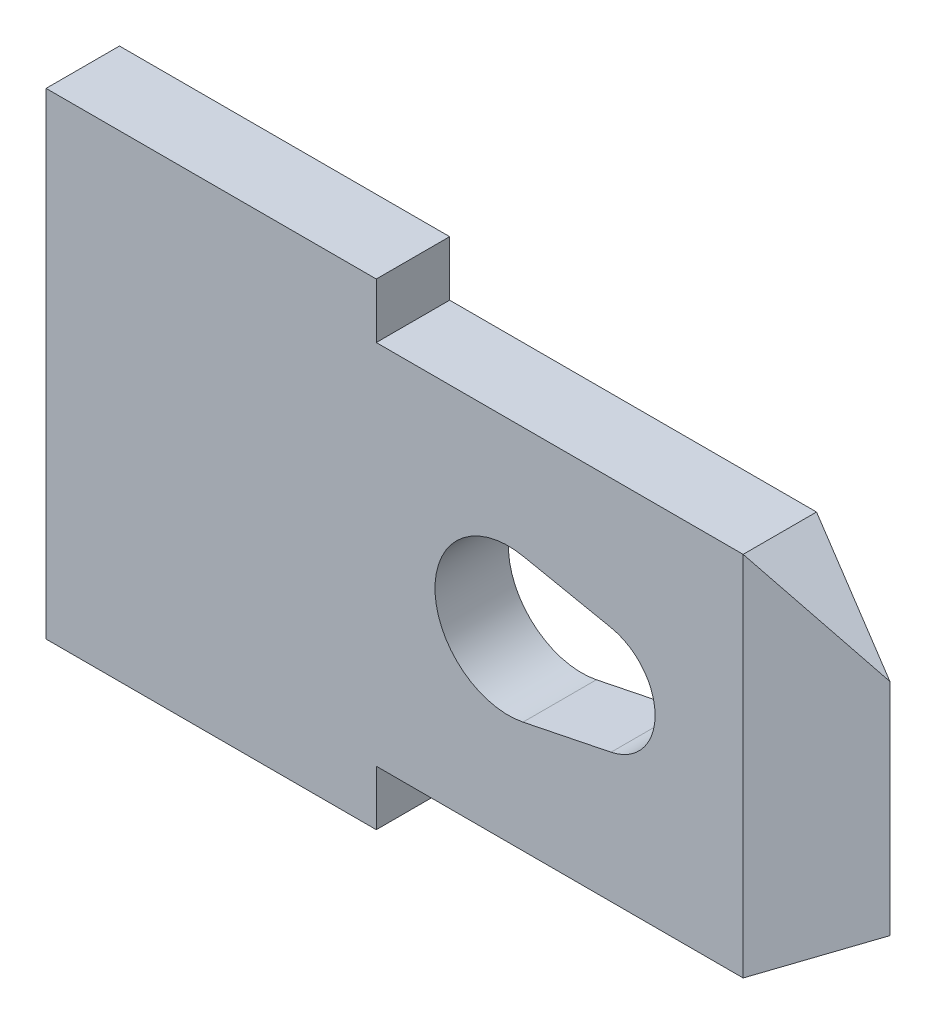
ISO-10303-21;
HEADER;
FILE_DESCRIPTION(('STEP AP214'),'2;1');
FILE_NAME('part.step','',(''),(''),'','','');
FILE_SCHEMA(('AUTOMOTIVE_DESIGN { 1 0 10303 214 1 1 1 1 }'));
ENDSEC;
DATA;
#1=APPLICATION_CONTEXT('core data for automotive mechanical design processes');
#2=APPLICATION_PROTOCOL_DEFINITION('international standard','automotive_design',2000,#1);
#3=PRODUCT_CONTEXT('',#1,'mechanical');
#4=PRODUCT('Part','Part','',(#3));
#5=PRODUCT_RELATED_PRODUCT_CATEGORY('part','',(#4));
#6=PRODUCT_DEFINITION_FORMATION('','',#4);
#7=PRODUCT_DEFINITION_CONTEXT('part definition',#1,'design');
#8=PRODUCT_DEFINITION('design','',#6,#7);
#9=PRODUCT_DEFINITION_SHAPE('','',#8);
#10=(LENGTH_UNIT() NAMED_UNIT(*) SI_UNIT(.MILLI.,.METRE.));
#11=(NAMED_UNIT(*) PLANE_ANGLE_UNIT() SI_UNIT($,.RADIAN.));
#12=(NAMED_UNIT(*) SI_UNIT($,.STERADIAN.) SOLID_ANGLE_UNIT());
#13=UNCERTAINTY_MEASURE_WITH_UNIT(LENGTH_MEASURE(1.E-05),#10,'distance_accuracy_value','');
#14=(GEOMETRIC_REPRESENTATION_CONTEXT(3) GLOBAL_UNCERTAINTY_ASSIGNED_CONTEXT((#13)) GLOBAL_UNIT_ASSIGNED_CONTEXT((#10,
#11,#12)) REPRESENTATION_CONTEXT('',''));
#15=CARTESIAN_POINT('',(0.,0.,0.));
#16=DIRECTION('',(0.,0.,1.));
#17=DIRECTION('',(1.,0.,0.));
#18=AXIS2_PLACEMENT_3D('',#15,#16,#17);
#19=CARTESIAN_POINT('',(9.5,-2.5,1.));
#20=DIRECTION('',(-0.554700196225229,0.832050294337844,0.));
#21=DIRECTION('',(-0.832050294337844,-0.554700196225229,0.));
#22=AXIS2_PLACEMENT_3D('',#19,#20,#21);
#23=PLANE('',#22);
#24=DIRECTION('',(0.801783725737273,0.534522483824849,0.267261241912424));
#25=VECTOR('',#24,1.);
#26=CARTESIAN_POINT('',(3.071,-6.786,-2.143));
#27=LINE('',#26,#25);
#28=CARTESIAN_POINT('',(9.5,-2.5,0.));
#29=VERTEX_POINT('',#28);
#30=CARTESIAN_POINT('',(11.,-1.5,0.499999999999999));
#31=VERTEX_POINT('',#30);
#32=EDGE_CURVE('E140',#29,#31,#27,.T.);
#33=ORIENTED_EDGE('',*,*,#32,.T.);
#34=DIRECTION('',(-0.801783725737273,-0.534522483824849,0.267261241912424));
#35=VECTOR('',#34,1.);
#36=CARTESIAN_POINT('',(3.28528571428572,-6.64314285714286,3.07157142857143));
#37=LINE('',#36,#35);
#38=CARTESIAN_POINT('',(9.5,-2.5,1.));
#39=VERTEX_POINT('',#38);
#40=EDGE_CURVE('E229',#31,#39,#37,.T.);
#41=ORIENTED_EDGE('',*,*,#40,.T.);
#42=DIRECTION('',(0.,0.,-1.));
#43=VECTOR('',#42,1.);
#44=CARTESIAN_POINT('',(9.5,-2.5,1.));
#45=LINE('',#44,#43);
#46=EDGE_CURVE('E183',#39,#29,#45,.T.);
#47=ORIENTED_EDGE('',*,*,#46,.T.);
#48=EDGE_LOOP('',(#33,#41,#47));
#49=FACE_BOUND('',#48,.T.);
#50=ADVANCED_FACE('F40',(#49),#23,.F.);
#51=CARTESIAN_POINT('',(9.5,2.5,1.));
#52=DIRECTION('',(-0.554700196225229,-0.832050294337844,0.));
#53=DIRECTION('',(0.832050294337844,-0.554700196225229,0.));
#54=AXIS2_PLACEMENT_3D('',#51,#52,#53);
#55=PLANE('',#54);
#56=DIRECTION('',(-0.801783725737273,0.534522483824849,-0.267261241912424));
#57=VECTOR('',#56,1.);
#58=CARTESIAN_POINT('',(5.85757142857143,4.92828571428571,-1.21414285714286));
#59=LINE('',#58,#57);
#60=CARTESIAN_POINT('',(11.,1.5,0.5));
#61=VERTEX_POINT('',#60);
#62=CARTESIAN_POINT('',(9.5,2.5,0.));
#63=VERTEX_POINT('',#62);
#64=EDGE_CURVE('E137',#61,#63,#59,.T.);
#65=ORIENTED_EDGE('',*,*,#64,.T.);
#66=DIRECTION('',(0.,0.,-1.));
#67=VECTOR('',#66,1.);
#68=CARTESIAN_POINT('',(9.5,2.5,1.));
#69=LINE('',#68,#67);
#70=CARTESIAN_POINT('',(9.5,2.5,1.));
#71=VERTEX_POINT('',#70);
#72=EDGE_CURVE('E12',#71,#63,#69,.T.);
#73=ORIENTED_EDGE('',*,*,#72,.F.);
#74=DIRECTION('',(0.801783725737273,-0.534522483824849,-0.267261241912424));
#75=VECTOR('',#74,1.);
#76=CARTESIAN_POINT('',(6.07185714285714,4.78542857142857,2.14271428571429));
#77=LINE('',#76,#75);
#78=EDGE_CURVE('E145',#71,#61,#77,.T.);
#79=ORIENTED_EDGE('',*,*,#78,.T.);
#80=EDGE_LOOP('',(#65,#73,#79));
#81=FACE_BOUND('',#80,.T.);
#82=ADVANCED_FACE('F150',(#81),#55,.F.);
#83=CARTESIAN_POINT('',(0.,0.,0.));
#84=DIRECTION('',(0.,0.,-1.));
#85=DIRECTION('',(-1.,0.,0.));
#86=AXIS2_PLACEMENT_3D('',#83,#84,#85);
#87=PLANE('',#86);
#88=CARTESIAN_POINT('',(6.3,0.,0.));
#89=DIRECTION('',(0.,0.,-1.));
#90=DIRECTION('',(-1.,0.,0.));
#91=AXIS2_PLACEMENT_3D('',#88,#89,#90);
#92=CIRCLE('',#91,1.);
#93=CARTESIAN_POINT('',(6.5,0.979795897113271,0.));
#94=VERTEX_POINT('',#93);
#95=CARTESIAN_POINT('',(6.5,-0.979795897113272,0.));
#96=VERTEX_POINT('',#95);
#97=EDGE_CURVE('E243',#94,#96,#92,.F.);
#98=ORIENTED_EDGE('',*,*,#97,.T.);
#99=DIRECTION('',(0.979795897113271,0.2,0.));
#100=VECTOR('',#99,1.);
#101=CARTESIAN_POINT('',(6.5,-0.979795897113272,0.));
#102=LINE('',#101,#100);
#103=CARTESIAN_POINT('',(7.7,-0.734846922834954,0.));
#104=VERTEX_POINT('',#103);
#105=EDGE_CURVE('E163',#96,#104,#102,.T.);
#106=ORIENTED_EDGE('',*,*,#105,.T.);
#107=CARTESIAN_POINT('',(7.55,0.,0.));
#108=DIRECTION('',(0.,0.,-1.));
#109=DIRECTION('',(-1.,0.,0.));
#110=AXIS2_PLACEMENT_3D('',#107,#108,#109);
#111=CIRCLE('',#110,0.75);
#112=CARTESIAN_POINT('',(7.7,0.734846922834953,0.));
#113=VERTEX_POINT('',#112);
#114=EDGE_CURVE('E236',#104,#113,#111,.F.);
#115=ORIENTED_EDGE('',*,*,#114,.T.);
#116=DIRECTION('',(-0.979795897113271,0.2,0.));
#117=VECTOR('',#116,1.);
#118=CARTESIAN_POINT('',(6.5,0.979795897113271,0.));
#119=LINE('',#118,#117);
#120=EDGE_CURVE('E240',#113,#94,#119,.T.);
#121=ORIENTED_EDGE('',*,*,#120,.T.);
#122=EDGE_LOOP('',(#98,#106,#115,#121));
#123=FACE_BOUND('',#122,.T.);
#124=DIRECTION('',(-1.,0.,0.));
#125=VECTOR('',#124,1.);
#126=CARTESIAN_POINT('',(4.5,2.5,0.));
#127=LINE('',#126,#125);
#128=CARTESIAN_POINT('',(4.5,2.5,0.));
#129=VERTEX_POINT('',#128);
#130=EDGE_CURVE('E156',#63,#129,#127,.T.);
#131=ORIENTED_EDGE('',*,*,#130,.F.);
#132=DIRECTION('',(0.,1.,0.));
#133=VECTOR('',#132,1.);
#134=CARTESIAN_POINT('',(9.5,-3.251,0.));
#135=LINE('',#134,#133);
#136=EDGE_CURVE('E134',#29,#63,#135,.T.);
#137=ORIENTED_EDGE('',*,*,#136,.F.);
#138=DIRECTION('',(1.,0.,0.));
#139=VECTOR('',#138,1.);
#140=CARTESIAN_POINT('',(4.5,-2.5,0.));
#141=LINE('',#140,#139);
#142=CARTESIAN_POINT('',(4.5,-2.5,0.));
#143=VERTEX_POINT('',#142);
#144=EDGE_CURVE('E181',#143,#29,#141,.T.);
#145=ORIENTED_EDGE('',*,*,#144,.F.);
#146=DIRECTION('',(0.,1.,0.));
#147=VECTOR('',#146,1.);
#148=CARTESIAN_POINT('',(4.5,-3.25,0.));
#149=LINE('',#148,#147);
#150=CARTESIAN_POINT('',(4.5,-3.25,0.));
#151=VERTEX_POINT('',#150);
#152=EDGE_CURVE('E179',#151,#143,#149,.T.);
#153=ORIENTED_EDGE('',*,*,#152,.F.);
#154=DIRECTION('',(1.,0.,0.));
#155=VECTOR('',#154,1.);
#156=CARTESIAN_POINT('',(0.,-3.25,0.));
#157=LINE('',#156,#155);
#158=CARTESIAN_POINT('',(0.,-3.25,0.));
#159=VERTEX_POINT('',#158);
#160=EDGE_CURVE('E177',#159,#151,#157,.T.);
#161=ORIENTED_EDGE('',*,*,#160,.F.);
#162=DIRECTION('',(0.,-1.,0.));
#163=VECTOR('',#162,1.);
#164=CARTESIAN_POINT('',(0.,-3.25,0.));
#165=LINE('',#164,#163);
#166=CARTESIAN_POINT('',(0.,3.25,0.));
#167=VERTEX_POINT('',#166);
#168=EDGE_CURVE('E175',#167,#159,#165,.T.);
#169=ORIENTED_EDGE('',*,*,#168,.F.);
#170=DIRECTION('',(-1.,0.,0.));
#171=VECTOR('',#170,1.);
#172=CARTESIAN_POINT('',(0.,3.25,0.));
#173=LINE('',#172,#171);
#174=CARTESIAN_POINT('',(4.5,3.25,0.));
#175=VERTEX_POINT('',#174);
#176=EDGE_CURVE('E165',#175,#167,#173,.T.);
#177=ORIENTED_EDGE('',*,*,#176,.F.);
#178=DIRECTION('',(0.,1.,0.));
#179=VECTOR('',#178,1.);
#180=CARTESIAN_POINT('',(4.5,3.25,0.));
#181=LINE('',#180,#179);
#182=EDGE_CURVE('E162',#129,#175,#181,.T.);
#183=ORIENTED_EDGE('',*,*,#182,.F.);
#184=EDGE_LOOP('',(#131,#137,#145,#153,#161,#169,#177,#183));
#185=FACE_BOUND('',#184,.T.);
#186=ADVANCED_FACE('F160',(#123,#185),#87,.T.);
#187=CARTESIAN_POINT('',(0.,0.,1.));
#188=DIRECTION('',(0.,0.,-1.));
#189=DIRECTION('',(-1.,0.,0.));
#190=AXIS2_PLACEMENT_3D('',#187,#188,#189);
#191=PLANE('',#190);
#192=DIRECTION('',(0.979795897113271,0.2,0.));
#193=VECTOR('',#192,1.);
#194=CARTESIAN_POINT('',(6.5,-0.979795897113272,1.));
#195=LINE('',#194,#193);
#196=CARTESIAN_POINT('',(6.5,-0.979795897113271,1.));
#197=VERTEX_POINT('',#196);
#198=CARTESIAN_POINT('',(7.7,-0.734846922834954,1.));
#199=VERTEX_POINT('',#198);
#200=EDGE_CURVE('E247',#197,#199,#195,.T.);
#201=ORIENTED_EDGE('',*,*,#200,.F.);
#202=CARTESIAN_POINT('',(6.3,0.,1.));
#203=DIRECTION('',(0.,0.,1.));
#204=DIRECTION('',(1.,0.,0.));
#205=AXIS2_PLACEMENT_3D('',#202,#203,#204);
#206=CIRCLE('',#205,1.);
#207=CARTESIAN_POINT('',(6.5,0.979795897113271,1.));
#208=VERTEX_POINT('',#207);
#209=EDGE_CURVE('E54',#208,#197,#206,.T.);
#210=ORIENTED_EDGE('',*,*,#209,.F.);
#211=DIRECTION('',(-0.979795897113271,0.2,0.));
#212=VECTOR('',#211,1.);
#213=CARTESIAN_POINT('',(6.5,0.979795897113271,1.));
#214=LINE('',#213,#212);
#215=CARTESIAN_POINT('',(7.7,0.734846922834953,1.));
#216=VERTEX_POINT('',#215);
#217=EDGE_CURVE('E252',#216,#208,#214,.T.);
#218=ORIENTED_EDGE('',*,*,#217,.F.);
#219=CARTESIAN_POINT('',(7.55,0.,1.));
#220=DIRECTION('',(0.,0.,1.));
#221=DIRECTION('',(1.,0.,0.));
#222=AXIS2_PLACEMENT_3D('',#219,#220,#221);
#223=CIRCLE('',#222,0.75);
#224=EDGE_CURVE('E249',#199,#216,#223,.T.);
#225=ORIENTED_EDGE('',*,*,#224,.F.);
#226=EDGE_LOOP('',(#201,#210,#218,#225));
#227=FACE_BOUND('',#226,.T.);
#228=DIRECTION('',(0.,1.,0.));
#229=VECTOR('',#228,1.);
#230=CARTESIAN_POINT('',(9.5,-3.251,1.));
#231=LINE('',#230,#229);
#232=EDGE_CURVE('E223',#39,#71,#231,.T.);
#233=ORIENTED_EDGE('',*,*,#232,.T.);
#234=DIRECTION('',(-1.,0.,0.));
#235=VECTOR('',#234,1.);
#236=CARTESIAN_POINT('',(4.5,2.5,1.));
#237=LINE('',#236,#235);
#238=CARTESIAN_POINT('',(4.5,2.5,1.));
#239=VERTEX_POINT('',#238);
#240=EDGE_CURVE('E158',#71,#239,#237,.T.);
#241=ORIENTED_EDGE('',*,*,#240,.T.);
#242=DIRECTION('',(0.,1.,0.));
#243=VECTOR('',#242,1.);
#244=CARTESIAN_POINT('',(4.5,3.25,1.));
#245=LINE('',#244,#243);
#246=CARTESIAN_POINT('',(4.5,3.25,1.));
#247=VERTEX_POINT('',#246);
#248=EDGE_CURVE('E204',#239,#247,#245,.T.);
#249=ORIENTED_EDGE('',*,*,#248,.T.);
#250=DIRECTION('',(-1.,0.,0.));
#251=VECTOR('',#250,1.);
#252=CARTESIAN_POINT('',(0.,3.25,1.));
#253=LINE('',#252,#251);
#254=CARTESIAN_POINT('',(0.,3.25,1.));
#255=VERTEX_POINT('',#254);
#256=EDGE_CURVE('E207',#247,#255,#253,.T.);
#257=ORIENTED_EDGE('',*,*,#256,.T.);
#258=DIRECTION('',(0.,-1.,0.));
#259=VECTOR('',#258,1.);
#260=CARTESIAN_POINT('',(0.,-3.25,1.));
#261=LINE('',#260,#259);
#262=CARTESIAN_POINT('',(0.,-3.25,1.));
#263=VERTEX_POINT('',#262);
#264=EDGE_CURVE('E209',#255,#263,#261,.T.);
#265=ORIENTED_EDGE('',*,*,#264,.T.);
#266=DIRECTION('',(1.,0.,0.));
#267=VECTOR('',#266,1.);
#268=CARTESIAN_POINT('',(0.,-3.25,1.));
#269=LINE('',#268,#267);
#270=CARTESIAN_POINT('',(4.5,-3.25,1.));
#271=VERTEX_POINT('',#270);
#272=EDGE_CURVE('E214',#263,#271,#269,.T.);
#273=ORIENTED_EDGE('',*,*,#272,.T.);
#274=DIRECTION('',(0.,1.,0.));
#275=VECTOR('',#274,1.);
#276=CARTESIAN_POINT('',(4.5,-3.25,1.));
#277=LINE('',#276,#275);
#278=CARTESIAN_POINT('',(4.5,-2.5,1.));
#279=VERTEX_POINT('',#278);
#280=EDGE_CURVE('E215',#271,#279,#277,.T.);
#281=ORIENTED_EDGE('',*,*,#280,.T.);
#282=DIRECTION('',(1.,0.,0.));
#283=VECTOR('',#282,1.);
#284=CARTESIAN_POINT('',(4.5,-2.5,1.));
#285=LINE('',#284,#283);
#286=EDGE_CURVE('E171',#279,#39,#285,.T.);
#287=ORIENTED_EDGE('',*,*,#286,.T.);
#288=EDGE_LOOP('',(#233,#241,#249,#257,#265,#273,#281,#287));
#289=FACE_BOUND('',#288,.T.);
#290=ADVANCED_FACE('F222',(#227,#289),#191,.F.);
#291=CARTESIAN_POINT('',(4.5,2.5,1.));
#292=DIRECTION('',(0.,-1.,0.));
#293=DIRECTION('',(0.,0.,-1.));
#294=AXIS2_PLACEMENT_3D('',#291,#292,#293);
#295=PLANE('',#294);
#296=ORIENTED_EDGE('',*,*,#130,.T.);
#297=DIRECTION('',(0.,0.,-1.));
#298=VECTOR('',#297,1.);
#299=CARTESIAN_POINT('',(4.5,2.5,1.));
#300=LINE('',#299,#298);
#301=EDGE_CURVE('E47',#239,#129,#300,.T.);
#302=ORIENTED_EDGE('',*,*,#301,.F.);
#303=ORIENTED_EDGE('',*,*,#240,.F.);
#304=ORIENTED_EDGE('',*,*,#72,.T.);
#305=EDGE_LOOP('',(#296,#302,#303,#304));
#306=FACE_BOUND('',#305,.T.);
#307=ADVANCED_FACE('F154',(#306),#295,.F.);
#308=CARTESIAN_POINT('',(4.5,3.25,1.));
#309=DIRECTION('',(-1.,0.,0.));
#310=DIRECTION('',(0.,0.,1.));
#311=AXIS2_PLACEMENT_3D('',#308,#309,#310);
#312=PLANE('',#311);
#313=ORIENTED_EDGE('',*,*,#182,.T.);
#314=DIRECTION('',(0.,0.,-1.));
#315=VECTOR('',#314,1.);
#316=CARTESIAN_POINT('',(4.5,3.25,1.));
#317=LINE('',#316,#315);
#318=EDGE_CURVE('E198',#247,#175,#317,.T.);
#319=ORIENTED_EDGE('',*,*,#318,.F.);
#320=ORIENTED_EDGE('',*,*,#248,.F.);
#321=ORIENTED_EDGE('',*,*,#301,.T.);
#322=EDGE_LOOP('',(#313,#319,#320,#321));
#323=FACE_BOUND('',#322,.T.);
#324=ADVANCED_FACE('F202',(#323),#312,.F.);
#325=CARTESIAN_POINT('',(0.,3.25,1.));
#326=DIRECTION('',(0.,-1.,0.));
#327=DIRECTION('',(0.,0.,-1.));
#328=AXIS2_PLACEMENT_3D('',#325,#326,#327);
#329=PLANE('',#328);
#330=ORIENTED_EDGE('',*,*,#176,.T.);
#331=DIRECTION('',(0.,0.,-1.));
#332=VECTOR('',#331,1.);
#333=CARTESIAN_POINT('',(0.,3.25,1.));
#334=LINE('',#333,#332);
#335=EDGE_CURVE('E195',#255,#167,#334,.T.);
#336=ORIENTED_EDGE('',*,*,#335,.F.);
#337=ORIENTED_EDGE('',*,*,#256,.F.);
#338=ORIENTED_EDGE('',*,*,#318,.T.);
#339=EDGE_LOOP('',(#330,#336,#337,#338));
#340=FACE_BOUND('',#339,.T.);
#341=ADVANCED_FACE('F296',(#340),#329,.F.);
#342=CARTESIAN_POINT('',(0.,-3.25,1.));
#343=DIRECTION('',(1.,0.,0.));
#344=DIRECTION('',(0.,0.,-1.));
#345=AXIS2_PLACEMENT_3D('',#342,#343,#344);
#346=PLANE('',#345);
#347=ORIENTED_EDGE('',*,*,#168,.T.);
#348=DIRECTION('',(0.,0.,-1.));
#349=VECTOR('',#348,1.);
#350=CARTESIAN_POINT('',(0.,-3.25,1.));
#351=LINE('',#350,#349);
#352=EDGE_CURVE('E192',#263,#159,#351,.T.);
#353=ORIENTED_EDGE('',*,*,#352,.F.);
#354=ORIENTED_EDGE('',*,*,#264,.F.);
#355=ORIENTED_EDGE('',*,*,#335,.T.);
#356=EDGE_LOOP('',(#347,#353,#354,#355));
#357=FACE_BOUND('',#356,.T.);
#358=ADVANCED_FACE('F299',(#357),#346,.F.);
#359=CARTESIAN_POINT('',(0.,-3.25,1.));
#360=DIRECTION('',(0.,1.,0.));
#361=DIRECTION('',(0.,0.,1.));
#362=AXIS2_PLACEMENT_3D('',#359,#360,#361);
#363=PLANE('',#362);
#364=ORIENTED_EDGE('',*,*,#160,.T.);
#365=DIRECTION('',(0.,0.,-1.));
#366=VECTOR('',#365,1.);
#367=CARTESIAN_POINT('',(4.5,-3.25,1.));
#368=LINE('',#367,#366);
#369=EDGE_CURVE('E189',#271,#151,#368,.T.);
#370=ORIENTED_EDGE('',*,*,#369,.F.);
#371=ORIENTED_EDGE('',*,*,#272,.F.);
#372=ORIENTED_EDGE('',*,*,#352,.T.);
#373=EDGE_LOOP('',(#364,#370,#371,#372));
#374=FACE_BOUND('',#373,.T.);
#375=ADVANCED_FACE('F303',(#374),#363,.F.);
#376=CARTESIAN_POINT('',(4.5,-3.25,1.));
#377=DIRECTION('',(-1.,0.,0.));
#378=DIRECTION('',(0.,0.,1.));
#379=AXIS2_PLACEMENT_3D('',#376,#377,#378);
#380=PLANE('',#379);
#381=ORIENTED_EDGE('',*,*,#152,.T.);
#382=DIRECTION('',(0.,0.,-1.));
#383=VECTOR('',#382,1.);
#384=CARTESIAN_POINT('',(4.5,-2.5,1.));
#385=LINE('',#384,#383);
#386=EDGE_CURVE('E186',#279,#143,#385,.T.);
#387=ORIENTED_EDGE('',*,*,#386,.F.);
#388=ORIENTED_EDGE('',*,*,#280,.F.);
#389=ORIENTED_EDGE('',*,*,#369,.T.);
#390=EDGE_LOOP('',(#381,#387,#388,#389));
#391=FACE_BOUND('',#390,.T.);
#392=ADVANCED_FACE('F307',(#391),#380,.F.);
#393=CARTESIAN_POINT('',(4.5,-2.5,1.));
#394=DIRECTION('',(0.,1.,0.));
#395=DIRECTION('',(0.,0.,1.));
#396=AXIS2_PLACEMENT_3D('',#393,#394,#395);
#397=PLANE('',#396);
#398=ORIENTED_EDGE('',*,*,#144,.T.);
#399=ORIENTED_EDGE('',*,*,#46,.F.);
#400=ORIENTED_EDGE('',*,*,#286,.F.);
#401=ORIENTED_EDGE('',*,*,#386,.T.);
#402=EDGE_LOOP('',(#398,#399,#400,#401));
#403=FACE_BOUND('',#402,.T.);
#404=ADVANCED_FACE('F225',(#403),#397,.F.);
#405=CARTESIAN_POINT('',(6.3,0.,-0.000999999999999916));
#406=DIRECTION('',(0.,0.,1.));
#407=DIRECTION('',(1.,0.,0.));
#408=AXIS2_PLACEMENT_3D('',#405,#406,#407);
#409=CYLINDRICAL_SURFACE('',#408,1.);
#410=DIRECTION('',(0.,0.,1.));
#411=VECTOR('',#410,1.);
#412=CARTESIAN_POINT('',(6.5,0.979795897113271,-0.000999999999999916));
#413=LINE('',#412,#411);
#414=EDGE_CURVE('E168',#94,#208,#413,.T.);
#415=ORIENTED_EDGE('',*,*,#414,.T.);
#416=ORIENTED_EDGE('',*,*,#209,.T.);
#417=DIRECTION('',(0.,0.,1.));
#418=VECTOR('',#417,1.);
#419=CARTESIAN_POINT('',(6.5,-0.979795897113272,-0.000999999999999916));
#420=LINE('',#419,#418);
#421=EDGE_CURVE('E255',#96,#197,#420,.T.);
#422=ORIENTED_EDGE('',*,*,#421,.F.);
#423=ORIENTED_EDGE('',*,*,#97,.F.);
#424=EDGE_LOOP('',(#415,#416,#422,#423));
#425=FACE_BOUND('',#424,.T.);
#426=ADVANCED_FACE('F270',(#425),#409,.F.);
#427=CARTESIAN_POINT('',(6.5,0.979795897113271,-0.000999999999999916));
#428=DIRECTION('',(0.2,0.979795897113271,0.));
#429=DIRECTION('',(-0.979795897113271,0.2,0.));
#430=AXIS2_PLACEMENT_3D('',#427,#428,#429);
#431=PLANE('',#430);
#432=DIRECTION('',(0.,0.,1.));
#433=VECTOR('',#432,1.);
#434=CARTESIAN_POINT('',(7.7,0.734846922834953,-0.000999999999999916));
#435=LINE('',#434,#433);
#436=EDGE_CURVE('E257',#113,#216,#435,.T.);
#437=ORIENTED_EDGE('',*,*,#436,.T.);
#438=ORIENTED_EDGE('',*,*,#217,.T.);
#439=ORIENTED_EDGE('',*,*,#414,.F.);
#440=ORIENTED_EDGE('',*,*,#120,.F.);
#441=EDGE_LOOP('',(#437,#438,#439,#440));
#442=FACE_BOUND('',#441,.T.);
#443=ADVANCED_FACE('F272',(#442),#431,.F.);
#444=CARTESIAN_POINT('',(7.55,0.,-0.000999999999999916));
#445=DIRECTION('',(0.,0.,1.));
#446=DIRECTION('',(1.,0.,0.));
#447=AXIS2_PLACEMENT_3D('',#444,#445,#446);
#448=CYLINDRICAL_SURFACE('',#447,0.75);
#449=DIRECTION('',(0.,0.,1.));
#450=VECTOR('',#449,1.);
#451=CARTESIAN_POINT('',(7.7,-0.734846922834954,-0.000999999999999916));
#452=LINE('',#451,#450);
#453=EDGE_CURVE('E62',#104,#199,#452,.T.);
#454=ORIENTED_EDGE('',*,*,#453,.T.);
#455=ORIENTED_EDGE('',*,*,#224,.T.);
#456=ORIENTED_EDGE('',*,*,#436,.F.);
#457=ORIENTED_EDGE('',*,*,#114,.F.);
#458=EDGE_LOOP('',(#454,#455,#456,#457));
#459=FACE_BOUND('',#458,.T.);
#460=ADVANCED_FACE('F267',(#459),#448,.F.);
#461=CARTESIAN_POINT('',(6.5,-0.979795897113272,-0.000999999999999916));
#462=DIRECTION('',(0.2,-0.979795897113271,0.));
#463=DIRECTION('',(0.979795897113271,0.2,0.));
#464=AXIS2_PLACEMENT_3D('',#461,#462,#463);
#465=PLANE('',#464);
#466=ORIENTED_EDGE('',*,*,#421,.T.);
#467=ORIENTED_EDGE('',*,*,#200,.T.);
#468=ORIENTED_EDGE('',*,*,#453,.F.);
#469=ORIENTED_EDGE('',*,*,#105,.F.);
#470=EDGE_LOOP('',(#466,#467,#468,#469));
#471=FACE_BOUND('',#470,.T.);
#472=ADVANCED_FACE('F261',(#471),#465,.F.);
#473=CARTESIAN_POINT('',(1.25,-3.251,3.75));
#474=DIRECTION('',(0.316227766016838,0.,0.948683298050514));
#475=DIRECTION('',(0.948683298050514,0.,-0.316227766016838));
#476=AXIS2_PLACEMENT_3D('',#473,#474,#475);
#477=PLANE('',#476);
#478=DIRECTION('',(0.,1.,0.));
#479=VECTOR('',#478,1.);
#480=CARTESIAN_POINT('',(11.,-3.251,0.5));
#481=LINE('',#480,#479);
#482=EDGE_CURVE('E231',#31,#61,#481,.T.);
#483=ORIENTED_EDGE('',*,*,#482,.T.);
#484=ORIENTED_EDGE('',*,*,#78,.F.);
#485=ORIENTED_EDGE('',*,*,#232,.F.);
#486=ORIENTED_EDGE('',*,*,#40,.F.);
#487=EDGE_LOOP('',(#483,#484,#485,#486));
#488=FACE_BOUND('',#487,.T.);
#489=ADVANCED_FACE('F316',(#488),#477,.T.);
#490=CARTESIAN_POINT('',(0.950000000000001,-3.251,-2.85));
#491=DIRECTION('',(0.316227766016838,0.,-0.948683298050514));
#492=DIRECTION('',(-0.948683298050514,0.,-0.316227766016838));
#493=AXIS2_PLACEMENT_3D('',#490,#491,#492);
#494=PLANE('',#493);
#495=ORIENTED_EDGE('',*,*,#136,.T.);
#496=ORIENTED_EDGE('',*,*,#64,.F.);
#497=ORIENTED_EDGE('',*,*,#482,.F.);
#498=ORIENTED_EDGE('',*,*,#32,.F.);
#499=EDGE_LOOP('',(#495,#496,#497,#498));
#500=FACE_BOUND('',#499,.T.);
#501=ADVANCED_FACE('F136',(#500),#494,.T.);
#502=CLOSED_SHELL('',(#50,#82,#186,#290,#307,#324,#341,#358,#375,#392,#404,#426,#443,#460,#472,
#489,#501));
#503=MANIFOLD_SOLID_BREP('B2',#502);
#504=ADVANCED_BREP_SHAPE_REPRESENTATION('',(#18,#503),#14);
#505=SHAPE_DEFINITION_REPRESENTATION(#9,#504);
ENDSEC;
END-ISO-10303-21;
